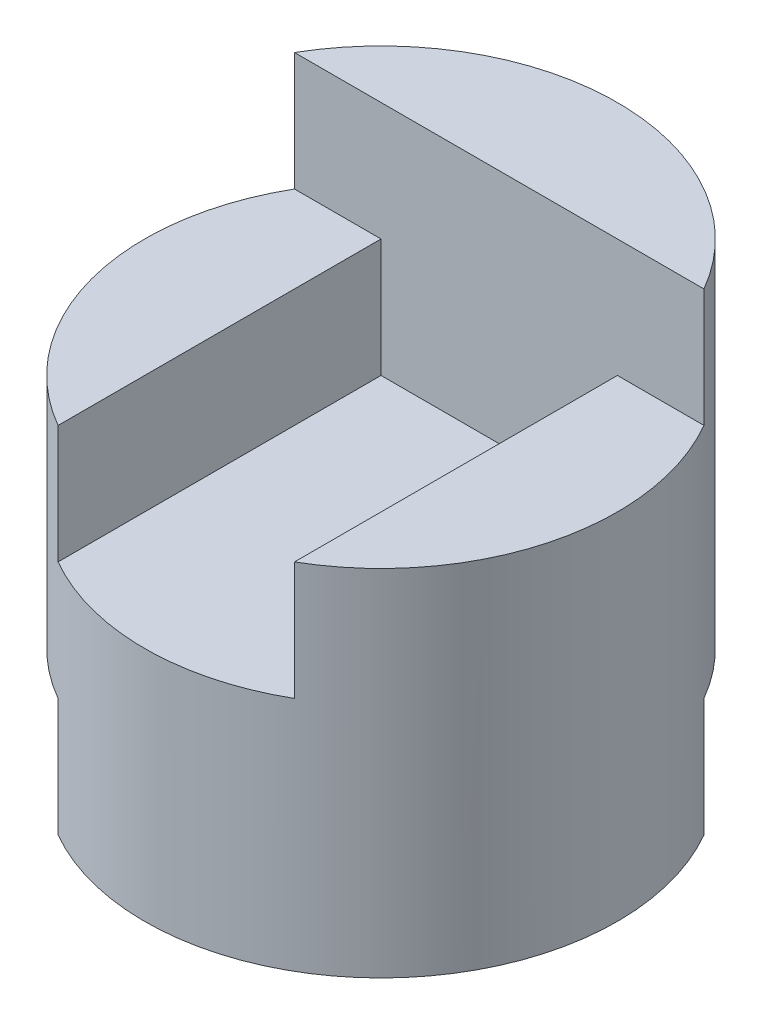
ISO-10303-21;
HEADER;
FILE_DESCRIPTION(('STEP AP214'),'2;1');
FILE_NAME('part.step','',(''),(''),'','','');
FILE_SCHEMA(('AUTOMOTIVE_DESIGN { 1 0 10303 214 1 1 1 1 }'));
ENDSEC;
DATA;
#1=APPLICATION_CONTEXT('core data for automotive mechanical design processes');
#2=APPLICATION_PROTOCOL_DEFINITION('international standard','automotive_design',2000,#1);
#3=PRODUCT_CONTEXT('',#1,'mechanical');
#4=PRODUCT('Part','Part','',(#3));
#5=PRODUCT_RELATED_PRODUCT_CATEGORY('part','',(#4));
#6=PRODUCT_DEFINITION_FORMATION('','',#4);
#7=PRODUCT_DEFINITION_CONTEXT('part definition',#1,'design');
#8=PRODUCT_DEFINITION('design','',#6,#7);
#9=PRODUCT_DEFINITION_SHAPE('','',#8);
#10=(LENGTH_UNIT() NAMED_UNIT(*) SI_UNIT(.MILLI.,.METRE.));
#11=(NAMED_UNIT(*) PLANE_ANGLE_UNIT() SI_UNIT($,.RADIAN.));
#12=(NAMED_UNIT(*) SI_UNIT($,.STERADIAN.) SOLID_ANGLE_UNIT());
#13=UNCERTAINTY_MEASURE_WITH_UNIT(LENGTH_MEASURE(1.E-05),#10,'distance_accuracy_value','');
#14=(GEOMETRIC_REPRESENTATION_CONTEXT(3) GLOBAL_UNCERTAINTY_ASSIGNED_CONTEXT((#13)) GLOBAL_UNIT_ASSIGNED_CONTEXT((#10,
#11,#12)) REPRESENTATION_CONTEXT('',''));
#15=CARTESIAN_POINT('',(0.,0.,0.));
#16=DIRECTION('',(0.,0.,1.));
#17=DIRECTION('',(1.,0.,0.));
#18=AXIS2_PLACEMENT_3D('',#15,#16,#17);
#19=CARTESIAN_POINT('',(0.,4.,0.));
#20=DIRECTION('',(0.,-1.,0.));
#21=DIRECTION('',(0.,0.,-1.));
#22=AXIS2_PLACEMENT_3D('',#19,#20,#21);
#23=CYLINDRICAL_SURFACE('',#22,2.);
#24=CARTESIAN_POINT('',(0.,0.,0.));
#25=DIRECTION('',(0.,1.,0.));
#26=DIRECTION('',(0.,0.,1.));
#27=AXIS2_PLACEMENT_3D('',#24,#25,#26);
#28=CIRCLE('',#27,2.);
#29=CARTESIAN_POINT('',(-1.,0.,1.73205080756888));
#30=VERTEX_POINT('',#29);
#31=CARTESIAN_POINT('',(1.73205080756888,0.,-1.));
#32=VERTEX_POINT('',#31);
#33=EDGE_CURVE('E127',#30,#32,#28,.T.);
#34=ORIENTED_EDGE('',*,*,#33,.T.);
#35=DIRECTION('',(0.,-1.,0.));
#36=VECTOR('',#35,1.);
#37=CARTESIAN_POINT('',(1.73205080756888,4.,-1.));
#38=LINE('',#37,#36);
#39=CARTESIAN_POINT('',(1.73205080756888,1.,-1.));
#40=VERTEX_POINT('',#39);
#41=EDGE_CURVE('E111',#32,#40,#38,.F.);
#42=ORIENTED_EDGE('',*,*,#41,.T.);
#43=CARTESIAN_POINT('',(0.,1.,0.));
#44=DIRECTION('',(0.,-1.,0.));
#45=DIRECTION('',(0.,0.,-1.));
#46=AXIS2_PLACEMENT_3D('',#43,#44,#45);
#47=CIRCLE('',#46,2.);
#48=CARTESIAN_POINT('',(-1.,1.,1.73205080756888));
#49=VERTEX_POINT('',#48);
#50=EDGE_CURVE('E131',#49,#40,#47,.T.);
#51=ORIENTED_EDGE('',*,*,#50,.F.);
#52=DIRECTION('',(0.,-1.,0.));
#53=VECTOR('',#52,1.);
#54=CARTESIAN_POINT('',(-1.,4.,1.73205080756888));
#55=LINE('',#54,#53);
#56=EDGE_CURVE('E163',#30,#49,#55,.F.);
#57=ORIENTED_EDGE('',*,*,#56,.F.);
#58=EDGE_LOOP('',(#34,#42,#51,#57));
#59=FACE_BOUND('',#58,.T.);
#60=DIRECTION('',(0.,-1.,0.));
#61=VECTOR('',#60,1.);
#62=CARTESIAN_POINT('',(1.73205080756888,4.,-1.));
#63=LINE('',#62,#61);
#64=CARTESIAN_POINT('',(1.73205080756888,4.,-1.));
#65=VERTEX_POINT('',#64);
#66=CARTESIAN_POINT('',(1.73205080756888,3.,-1.));
#67=VERTEX_POINT('',#66);
#68=EDGE_CURVE('E47',#65,#67,#63,.T.);
#69=ORIENTED_EDGE('',*,*,#68,.T.);
#70=CARTESIAN_POINT('',(0.,3.,0.));
#71=DIRECTION('',(0.,1.,0.));
#72=DIRECTION('',(-1.,0.,0.));
#73=AXIS2_PLACEMENT_3D('',#70,#71,#72);
#74=CIRCLE('',#73,2.);
#75=CARTESIAN_POINT('',(1.,3.,1.73205080756888));
#76=VERTEX_POINT('',#75);
#77=EDGE_CURVE('E11',#76,#67,#74,.T.);
#78=ORIENTED_EDGE('',*,*,#77,.F.);
#79=DIRECTION('',(0.,-1.,0.));
#80=VECTOR('',#79,1.);
#81=CARTESIAN_POINT('',(0.999999999999999,4.,1.73205080756888));
#82=LINE('',#81,#80);
#83=CARTESIAN_POINT('',(1.,2.,1.73205080756888));
#84=VERTEX_POINT('',#83);
#85=EDGE_CURVE('E40',#84,#76,#82,.F.);
#86=ORIENTED_EDGE('',*,*,#85,.F.);
#87=CARTESIAN_POINT('',(0.,2.,0.));
#88=DIRECTION('',(0.,1.,0.));
#89=DIRECTION('',(0.,0.,1.));
#90=AXIS2_PLACEMENT_3D('',#87,#88,#89);
#91=CIRCLE('',#90,2.);
#92=CARTESIAN_POINT('',(-1.,2.,1.73205080756888));
#93=VERTEX_POINT('',#92);
#94=EDGE_CURVE('E141',#93,#84,#91,.T.);
#95=ORIENTED_EDGE('',*,*,#94,.F.);
#96=DIRECTION('',(0.,-1.,0.));
#97=VECTOR('',#96,1.);
#98=CARTESIAN_POINT('',(-1.,4.,1.73205080756888));
#99=LINE('',#98,#97);
#100=CARTESIAN_POINT('',(-1.,3.,1.73205080756888));
#101=VERTEX_POINT('',#100);
#102=EDGE_CURVE('E139',#101,#93,#99,.T.);
#103=ORIENTED_EDGE('',*,*,#102,.F.);
#104=CARTESIAN_POINT('',(0.,3.,0.));
#105=DIRECTION('',(0.,1.,0.));
#106=DIRECTION('',(-1.,0.,0.));
#107=AXIS2_PLACEMENT_3D('',#104,#105,#106);
#108=CIRCLE('',#107,2.);
#109=CARTESIAN_POINT('',(-1.73205080756888,3.,-1.));
#110=VERTEX_POINT('',#109);
#111=EDGE_CURVE('E55',#110,#101,#108,.T.);
#112=ORIENTED_EDGE('',*,*,#111,.F.);
#113=DIRECTION('',(0.,-1.,0.));
#114=VECTOR('',#113,1.);
#115=CARTESIAN_POINT('',(-1.73205080756888,4.,-1.));
#116=LINE('',#115,#114);
#117=CARTESIAN_POINT('',(-1.73205080756888,4.,-1.));
#118=VERTEX_POINT('',#117);
#119=EDGE_CURVE('E161',#110,#118,#116,.F.);
#120=ORIENTED_EDGE('',*,*,#119,.T.);
#121=CARTESIAN_POINT('',(0.,4.,0.));
#122=DIRECTION('',(0.,1.,0.));
#123=DIRECTION('',(0.,0.,1.));
#124=AXIS2_PLACEMENT_3D('',#121,#122,#123);
#125=CIRCLE('',#124,2.);
#126=EDGE_CURVE('E129',#65,#118,#125,.T.);
#127=ORIENTED_EDGE('',*,*,#126,.F.);
#128=EDGE_LOOP('',(#69,#78,#86,#95,#103,#112,#120,#127));
#129=FACE_BOUND('',#128,.T.);
#130=ADVANCED_FACE('F33',(#59,#129),#23,.T.);
#131=CARTESIAN_POINT('',(0.,0.,0.));
#132=DIRECTION('',(0.,1.,0.));
#133=DIRECTION('',(0.,0.,1.));
#134=AXIS2_PLACEMENT_3D('',#131,#132,#133);
#135=PLANE('',#134);
#136=DIRECTION('',(0.,0.,1.));
#137=VECTOR('',#136,1.);
#138=CARTESIAN_POINT('',(-1.,0.,0.));
#139=LINE('',#138,#137);
#140=CARTESIAN_POINT('',(-1.,0.,-1.));
#141=VERTEX_POINT('',#140);
#142=EDGE_CURVE('E121',#141,#30,#139,.T.);
#143=ORIENTED_EDGE('',*,*,#142,.F.);
#144=DIRECTION('',(1.,0.,0.));
#145=VECTOR('',#144,1.);
#146=CARTESIAN_POINT('',(-5.5,0.,-1.));
#147=LINE('',#146,#145);
#148=EDGE_CURVE('E104',#141,#32,#147,.T.);
#149=ORIENTED_EDGE('',*,*,#148,.T.);
#150=ORIENTED_EDGE('',*,*,#33,.F.);
#151=EDGE_LOOP('',(#143,#149,#150));
#152=FACE_BOUND('',#151,.T.);
#153=ADVANCED_FACE('F126',(#152),#135,.F.);
#154=CARTESIAN_POINT('',(0.,4.,0.));
#155=DIRECTION('',(0.,1.,0.));
#156=DIRECTION('',(0.,0.,1.));
#157=AXIS2_PLACEMENT_3D('',#154,#155,#156);
#158=PLANE('',#157);
#159=DIRECTION('',(-1.,0.,0.));
#160=VECTOR('',#159,1.);
#161=CARTESIAN_POINT('',(0.,4.,-1.));
#162=LINE('',#161,#160);
#163=EDGE_CURVE('E128',#65,#118,#162,.T.);
#164=ORIENTED_EDGE('',*,*,#163,.F.);
#165=ORIENTED_EDGE('',*,*,#126,.T.);
#166=EDGE_LOOP('',(#164,#165));
#167=FACE_BOUND('',#166,.T.);
#168=ADVANCED_FACE('F190',(#167),#158,.T.);
#169=CARTESIAN_POINT('',(-2.,1.,11.));
#170=DIRECTION('',(0.,-1.,0.));
#171=DIRECTION('',(0.,0.,-1.));
#172=AXIS2_PLACEMENT_3D('',#169,#170,#171);
#173=PLANE('',#172);
#174=DIRECTION('',(0.,0.,-1.));
#175=VECTOR('',#174,1.);
#176=CARTESIAN_POINT('',(-1.,1.,11.));
#177=LINE('',#176,#175);
#178=CARTESIAN_POINT('',(-1.,1.,-1.));
#179=VERTEX_POINT('',#178);
#180=EDGE_CURVE('E124',#49,#179,#177,.T.);
#181=ORIENTED_EDGE('',*,*,#180,.F.);
#182=ORIENTED_EDGE('',*,*,#50,.T.);
#183=DIRECTION('',(1.,0.,0.));
#184=VECTOR('',#183,1.);
#185=CARTESIAN_POINT('',(-5.5,1.,-1.));
#186=LINE('',#185,#184);
#187=EDGE_CURVE('E116',#179,#40,#186,.T.);
#188=ORIENTED_EDGE('',*,*,#187,.F.);
#189=EDGE_LOOP('',(#181,#182,#188));
#190=FACE_BOUND('',#189,.T.);
#191=ADVANCED_FACE('F188',(#190),#173,.T.);
#192=CARTESIAN_POINT('',(-1.,0.,11.));
#193=DIRECTION('',(-1.,0.,0.));
#194=DIRECTION('',(0.,0.,1.));
#195=AXIS2_PLACEMENT_3D('',#192,#193,#194);
#196=PLANE('',#195);
#197=ORIENTED_EDGE('',*,*,#56,.T.);
#198=ORIENTED_EDGE('',*,*,#180,.T.);
#199=DIRECTION('',(0.,1.,0.));
#200=VECTOR('',#199,1.);
#201=CARTESIAN_POINT('',(-1.,0.,-1.));
#202=LINE('',#201,#200);
#203=EDGE_CURVE('E108',#141,#179,#202,.T.);
#204=ORIENTED_EDGE('',*,*,#203,.F.);
#205=ORIENTED_EDGE('',*,*,#142,.T.);
#206=EDGE_LOOP('',(#197,#198,#204,#205));
#207=FACE_BOUND('',#206,.T.);
#208=ADVANCED_FACE('F120',(#207),#196,.T.);
#209=CARTESIAN_POINT('',(-1.,3.,11.));
#210=DIRECTION('',(0.,1.,0.));
#211=DIRECTION('',(-1.,0.,0.));
#212=AXIS2_PLACEMENT_3D('',#209,#210,#211);
#213=PLANE('',#212);
#214=ORIENTED_EDGE('',*,*,#111,.T.);
#215=DIRECTION('',(0.,0.,-1.));
#216=VECTOR('',#215,1.);
#217=CARTESIAN_POINT('',(-1.,3.,11.));
#218=LINE('',#217,#216);
#219=CARTESIAN_POINT('',(-1.,3.,-1.));
#220=VERTEX_POINT('',#219);
#221=EDGE_CURVE('E167',#101,#220,#218,.T.);
#222=ORIENTED_EDGE('',*,*,#221,.T.);
#223=DIRECTION('',(1.,0.,0.));
#224=VECTOR('',#223,1.);
#225=CARTESIAN_POINT('',(-1.,3.,-1.));
#226=LINE('',#225,#224);
#227=EDGE_CURVE('E168',#110,#220,#226,.T.);
#228=ORIENTED_EDGE('',*,*,#227,.F.);
#229=EDGE_LOOP('',(#214,#222,#228));
#230=FACE_BOUND('',#229,.T.);
#231=ADVANCED_FACE('F196',(#230),#213,.T.);
#232=CARTESIAN_POINT('',(-1.,2.,11.));
#233=DIRECTION('',(1.,0.,0.));
#234=DIRECTION('',(0.,0.,-1.));
#235=AXIS2_PLACEMENT_3D('',#232,#233,#234);
#236=PLANE('',#235);
#237=ORIENTED_EDGE('',*,*,#102,.T.);
#238=DIRECTION('',(0.,0.,-1.));
#239=VECTOR('',#238,1.);
#240=CARTESIAN_POINT('',(-1.,2.,11.));
#241=LINE('',#240,#239);
#242=CARTESIAN_POINT('',(-1.,2.,-1.));
#243=VERTEX_POINT('',#242);
#244=EDGE_CURVE('E171',#93,#243,#241,.T.);
#245=ORIENTED_EDGE('',*,*,#244,.T.);
#246=DIRECTION('',(0.,-1.,0.));
#247=VECTOR('',#246,1.);
#248=CARTESIAN_POINT('',(-1.,2.,-1.));
#249=LINE('',#248,#247);
#250=EDGE_CURVE('E180',#220,#243,#249,.T.);
#251=ORIENTED_EDGE('',*,*,#250,.F.);
#252=ORIENTED_EDGE('',*,*,#221,.F.);
#253=EDGE_LOOP('',(#237,#245,#251,#252));
#254=FACE_BOUND('',#253,.T.);
#255=ADVANCED_FACE('F220',(#254),#236,.T.);
#256=CARTESIAN_POINT('',(1.,2.,11.));
#257=DIRECTION('',(0.,1.,0.));
#258=DIRECTION('',(0.,0.,1.));
#259=AXIS2_PLACEMENT_3D('',#256,#257,#258);
#260=PLANE('',#259);
#261=ORIENTED_EDGE('',*,*,#94,.T.);
#262=DIRECTION('',(0.,0.,-1.));
#263=VECTOR('',#262,1.);
#264=CARTESIAN_POINT('',(1.,2.,11.));
#265=LINE('',#264,#263);
#266=CARTESIAN_POINT('',(1.,2.,-1.));
#267=VERTEX_POINT('',#266);
#268=EDGE_CURVE('E150',#84,#267,#265,.T.);
#269=ORIENTED_EDGE('',*,*,#268,.T.);
#270=DIRECTION('',(1.,0.,0.));
#271=VECTOR('',#270,1.);
#272=CARTESIAN_POINT('',(1.,2.,-1.));
#273=LINE('',#272,#271);
#274=EDGE_CURVE('E177',#243,#267,#273,.T.);
#275=ORIENTED_EDGE('',*,*,#274,.F.);
#276=ORIENTED_EDGE('',*,*,#244,.F.);
#277=EDGE_LOOP('',(#261,#269,#275,#276));
#278=FACE_BOUND('',#277,.T.);
#279=ADVANCED_FACE('F229',(#278),#260,.T.);
#280=CARTESIAN_POINT('',(1.,3.,11.));
#281=DIRECTION('',(-1.,0.,0.));
#282=DIRECTION('',(0.,-1.,0.));
#283=AXIS2_PLACEMENT_3D('',#280,#281,#282);
#284=PLANE('',#283);
#285=ORIENTED_EDGE('',*,*,#85,.T.);
#286=DIRECTION('',(0.,0.,-1.));
#287=VECTOR('',#286,1.);
#288=CARTESIAN_POINT('',(1.,3.,11.));
#289=LINE('',#288,#287);
#290=CARTESIAN_POINT('',(1.,3.,-1.));
#291=VERTEX_POINT('',#290);
#292=EDGE_CURVE('E148',#76,#291,#289,.T.);
#293=ORIENTED_EDGE('',*,*,#292,.T.);
#294=DIRECTION('',(0.,1.,0.));
#295=VECTOR('',#294,1.);
#296=CARTESIAN_POINT('',(1.,3.,-1.));
#297=LINE('',#296,#295);
#298=EDGE_CURVE('E175',#267,#291,#297,.T.);
#299=ORIENTED_EDGE('',*,*,#298,.F.);
#300=ORIENTED_EDGE('',*,*,#268,.F.);
#301=EDGE_LOOP('',(#285,#293,#299,#300));
#302=FACE_BOUND('',#301,.T.);
#303=ADVANCED_FACE('F146',(#302),#284,.T.);
#304=CARTESIAN_POINT('',(2.,3.,11.));
#305=DIRECTION('',(0.,1.,0.));
#306=DIRECTION('',(-1.,0.,0.));
#307=AXIS2_PLACEMENT_3D('',#304,#305,#306);
#308=PLANE('',#307);
#309=ORIENTED_EDGE('',*,*,#77,.T.);
#310=DIRECTION('',(1.,0.,0.));
#311=VECTOR('',#310,1.);
#312=CARTESIAN_POINT('',(2.,3.,-1.));
#313=LINE('',#312,#311);
#314=EDGE_CURVE('E156',#291,#67,#313,.T.);
#315=ORIENTED_EDGE('',*,*,#314,.F.);
#316=ORIENTED_EDGE('',*,*,#292,.F.);
#317=EDGE_LOOP('',(#309,#315,#316));
#318=FACE_BOUND('',#317,.T.);
#319=ADVANCED_FACE('F155',(#318),#308,.T.);
#320=CARTESIAN_POINT('',(0.,0.,-1.));
#321=DIRECTION('',(0.,0.,-1.));
#322=DIRECTION('',(-1.,0.,0.));
#323=AXIS2_PLACEMENT_3D('',#320,#321,#322);
#324=PLANE('',#323);
#325=ORIENTED_EDGE('',*,*,#163,.T.);
#326=ORIENTED_EDGE('',*,*,#119,.F.);
#327=ORIENTED_EDGE('',*,*,#227,.T.);
#328=ORIENTED_EDGE('',*,*,#250,.T.);
#329=ORIENTED_EDGE('',*,*,#274,.T.);
#330=ORIENTED_EDGE('',*,*,#298,.T.);
#331=ORIENTED_EDGE('',*,*,#314,.T.);
#332=ORIENTED_EDGE('',*,*,#68,.F.);
#333=EDGE_LOOP('',(#325,#326,#327,#328,#329,#330,#331,#332));
#334=FACE_BOUND('',#333,.T.);
#335=ADVANCED_FACE('F256',(#334),#324,.F.);
#336=CARTESIAN_POINT('',(-5.5,1.,-1.));
#337=DIRECTION('',(0.,0.,1.));
#338=DIRECTION('',(1.,0.,0.));
#339=AXIS2_PLACEMENT_3D('',#336,#337,#338);
#340=PLANE('',#339);
#341=ORIENTED_EDGE('',*,*,#148,.F.);
#342=ORIENTED_EDGE('',*,*,#203,.T.);
#343=ORIENTED_EDGE('',*,*,#187,.T.);
#344=ORIENTED_EDGE('',*,*,#41,.F.);
#345=EDGE_LOOP('',(#341,#342,#343,#344));
#346=FACE_BOUND('',#345,.T.);
#347=ADVANCED_FACE('F106',(#346),#340,.F.);
#348=CLOSED_SHELL('',(#130,#153,#168,#191,#208,#231,#255,#279,#303,#319,#335,#347));
#349=MANIFOLD_SOLID_BREP('B2',#348);
#350=ADVANCED_BREP_SHAPE_REPRESENTATION('',(#18,#349),#14);
#351=SHAPE_DEFINITION_REPRESENTATION(#9,#350);
ENDSEC;
END-ISO-10303-21;
